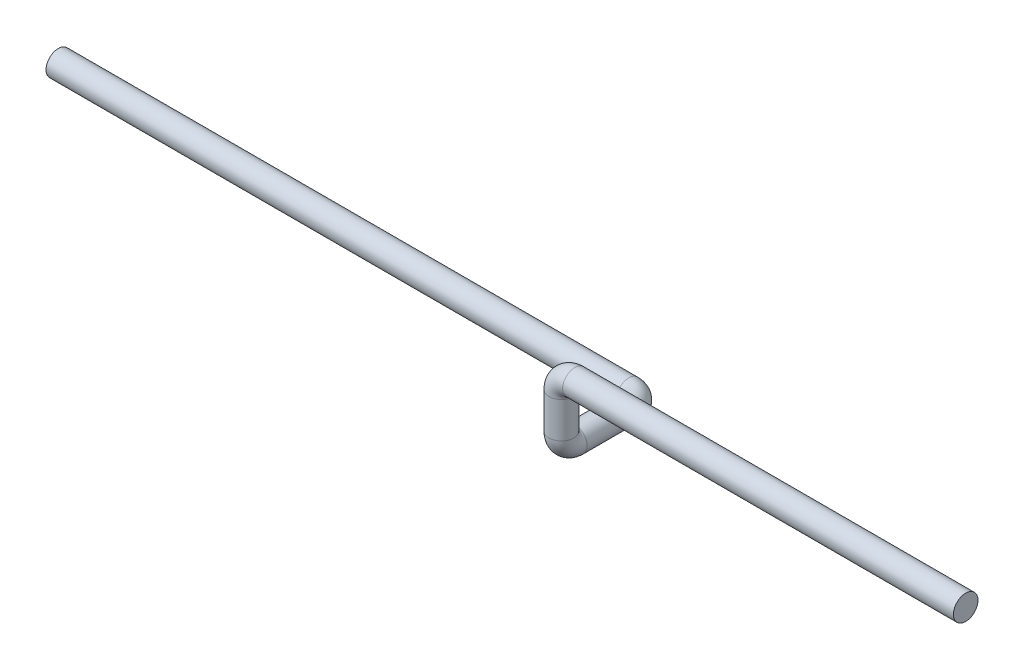
ISO-10303-21;
HEADER;
FILE_DESCRIPTION(('STEP AP214'),'2;1');
FILE_NAME('part.step','',(''),(''),'','','');
FILE_SCHEMA(('AUTOMOTIVE_DESIGN { 1 0 10303 214 1 1 1 1 }'));
ENDSEC;
DATA;
#1=APPLICATION_CONTEXT('core data for automotive mechanical design processes');
#2=APPLICATION_PROTOCOL_DEFINITION('international standard','automotive_design',2000,#1);
#3=PRODUCT_CONTEXT('',#1,'mechanical');
#4=PRODUCT('Part','Part','',(#3));
#5=PRODUCT_RELATED_PRODUCT_CATEGORY('part','',(#4));
#6=PRODUCT_DEFINITION_FORMATION('','',#4);
#7=PRODUCT_DEFINITION_CONTEXT('part definition',#1,'design');
#8=PRODUCT_DEFINITION('design','',#6,#7);
#9=PRODUCT_DEFINITION_SHAPE('','',#8);
#10=(LENGTH_UNIT() NAMED_UNIT(*) SI_UNIT(.MILLI.,.METRE.));
#11=(NAMED_UNIT(*) PLANE_ANGLE_UNIT() SI_UNIT($,.RADIAN.));
#12=(NAMED_UNIT(*) SI_UNIT($,.STERADIAN.) SOLID_ANGLE_UNIT());
#13=UNCERTAINTY_MEASURE_WITH_UNIT(LENGTH_MEASURE(1.E-05),#10,'distance_accuracy_value','');
#14=(GEOMETRIC_REPRESENTATION_CONTEXT(3) GLOBAL_UNCERTAINTY_ASSIGNED_CONTEXT((#13)) GLOBAL_UNIT_ASSIGNED_CONTEXT((#10,
#11,#12)) REPRESENTATION_CONTEXT('',''));
#15=CARTESIAN_POINT('',(0.,0.,0.));
#16=DIRECTION('',(0.,0.,1.));
#17=DIRECTION('',(1.,0.,0.));
#18=AXIS2_PLACEMENT_3D('',#15,#16,#17);
#19=CARTESIAN_POINT('',(0.,0.,0.));
#20=DIRECTION('',(1.,0.,0.));
#21=DIRECTION('',(0.,0.,-1.));
#22=AXIS2_PLACEMENT_3D('',#19,#20,#21);
#23=PLANE('',#22);
#24=CARTESIAN_POINT('',(0.,0.,0.));
#25=DIRECTION('',(1.,0.,0.));
#26=DIRECTION('',(0.,0.,-1.));
#27=AXIS2_PLACEMENT_3D('',#24,#25,#26);
#28=CIRCLE('',#27,13.7);
#29=CARTESIAN_POINT('',(0.,0.,-13.7));
#30=VERTEX_POINT('',#29);
#31=EDGE_CURVE('E47',#30,#30,#28,.T.);
#32=ORIENTED_EDGE('',*,*,#31,.T.);
#33=EDGE_LOOP('',(#32));
#34=FACE_BOUND('',#33,.T.);
#35=ADVANCED_FACE('F35',(#34),#23,.T.);
#36=CARTESIAN_POINT('',(-1100.,-70.,-90.));
#37=DIRECTION('',(1.,0.,0.));
#38=DIRECTION('',(0.,1.,0.));
#39=AXIS2_PLACEMENT_3D('',#36,#37,#38);
#40=PLANE('',#39);
#41=CARTESIAN_POINT('',(-1100.,-70.,-90.));
#42=DIRECTION('',(1.,0.,0.));
#43=DIRECTION('',(0.,1.,0.));
#44=AXIS2_PLACEMENT_3D('',#41,#42,#43);
#45=CIRCLE('',#44,13.7);
#46=CARTESIAN_POINT('',(-1100.,-56.3,-90.));
#47=VERTEX_POINT('',#46);
#48=EDGE_CURVE('E11',#47,#47,#45,.T.);
#49=ORIENTED_EDGE('',*,*,#48,.F.);
#50=EDGE_LOOP('',(#49));
#51=FACE_BOUND('',#50,.T.);
#52=ADVANCED_FACE('F53',(#51),#40,.F.);
#53=CARTESIAN_POINT('',(0.,0.,0.));
#54=DIRECTION('',(-1.,0.,0.));
#55=DIRECTION('',(0.,0.,1.));
#56=AXIS2_PLACEMENT_3D('',#53,#54,#55);
#57=CYLINDRICAL_SURFACE('',#56,13.7);
#58=CARTESIAN_POINT('',(-435.,0.,0.));
#59=DIRECTION('',(1.,0.,0.));
#60=DIRECTION('',(0.,0.,-1.));
#61=AXIS2_PLACEMENT_3D('',#58,#59,#60);
#62=CIRCLE('',#61,13.7);
#63=CARTESIAN_POINT('',(-435.,13.7,0.));
#64=VERTEX_POINT('',#63);
#65=EDGE_CURVE('E95',#64,#64,#62,.T.);
#66=ORIENTED_EDGE('',*,*,#65,.T.);
#67=EDGE_LOOP('',(#66));
#68=FACE_BOUND('',#67,.T.);
#69=ORIENTED_EDGE('',*,*,#31,.F.);
#70=EDGE_LOOP('',(#69));
#71=FACE_BOUND('',#70,.T.);
#72=ADVANCED_FACE('F55',(#68,#71),#57,.T.);
#73=CARTESIAN_POINT('',(-435.,-15.,0.));
#74=DIRECTION('',(0.,0.,1.));
#75=DIRECTION('',(1.,0.,0.));
#76=AXIS2_PLACEMENT_3D('',#73,#74,#75);
#77=TOROIDAL_SURFACE('',#76,15.,13.7);
#78=CARTESIAN_POINT('',(-450.,-15.,0.));
#79=DIRECTION('',(0.,1.,0.));
#80=DIRECTION('',(0.,0.,-1.));
#81=AXIS2_PLACEMENT_3D('',#78,#79,#80);
#82=CIRCLE('',#81,13.7);
#83=CARTESIAN_POINT('',(-463.7,-15.,0.));
#84=VERTEX_POINT('',#83);
#85=EDGE_CURVE('E92',#84,#84,#82,.T.);
#86=CARTESIAN_POINT('',(-435.,-15.,0.));
#87=DIRECTION('',(0.,0.,1.));
#88=DIRECTION('',(1.,0.,0.));
#89=AXIS2_PLACEMENT_3D('',#86,#87,#88);
#90=CIRCLE('',#89,28.7);
#91=EDGE_CURVE('',#64,#84,#90,.T.);
#92=ORIENTED_EDGE('',*,*,#65,.F.);
#93=ORIENTED_EDGE('',*,*,#85,.T.);
#94=ORIENTED_EDGE('',*,*,#91,.T.);
#95=ORIENTED_EDGE('',*,*,#91,.F.);
#96=EDGE_LOOP('',(#92,#94,#93,#95));
#97=FACE_BOUND('',#96,.T.);
#98=ADVANCED_FACE('F60',(#97),#77,.T.);
#99=CARTESIAN_POINT('',(-450.,-15.,0.));
#100=DIRECTION('',(0.,-1.,0.));
#101=DIRECTION('',(0.,0.,-1.));
#102=AXIS2_PLACEMENT_3D('',#99,#100,#101);
#103=CYLINDRICAL_SURFACE('',#102,13.7);
#104=CARTESIAN_POINT('',(-450.,-55.,0.));
#105=DIRECTION('',(0.,1.,0.));
#106=DIRECTION('',(0.,0.,-1.));
#107=AXIS2_PLACEMENT_3D('',#104,#105,#106);
#108=CIRCLE('',#107,13.7);
#109=CARTESIAN_POINT('',(-450.,-55.,13.7));
#110=VERTEX_POINT('',#109);
#111=EDGE_CURVE('E97',#110,#110,#108,.T.);
#112=ORIENTED_EDGE('',*,*,#111,.T.);
#113=EDGE_LOOP('',(#112));
#114=FACE_BOUND('',#113,.T.);
#115=ORIENTED_EDGE('',*,*,#85,.F.);
#116=EDGE_LOOP('',(#115));
#117=FACE_BOUND('',#116,.T.);
#118=ADVANCED_FACE('F80',(#114,#117),#103,.T.);
#119=CARTESIAN_POINT('',(-450.,-55.,-15.));
#120=DIRECTION('',(1.,0.,0.));
#121=DIRECTION('',(0.,0.,-1.));
#122=AXIS2_PLACEMENT_3D('',#119,#120,#121);
#123=TOROIDAL_SURFACE('',#122,15.,13.7);
#124=CARTESIAN_POINT('',(-450.,-70.,-15.));
#125=DIRECTION('',(0.,0.,1.));
#126=DIRECTION('',(0.,1.,0.));
#127=AXIS2_PLACEMENT_3D('',#124,#125,#126);
#128=CIRCLE('',#127,13.7);
#129=CARTESIAN_POINT('',(-450.,-83.7,-15.));
#130=VERTEX_POINT('',#129);
#131=EDGE_CURVE('E103',#130,#130,#128,.T.);
#132=CARTESIAN_POINT('',(-450.,-55.,-15.));
#133=DIRECTION('',(1.,0.,0.));
#134=DIRECTION('',(0.,0.,-1.));
#135=AXIS2_PLACEMENT_3D('',#132,#133,#134);
#136=CIRCLE('',#135,28.7);
#137=EDGE_CURVE('',#110,#130,#136,.T.);
#138=ORIENTED_EDGE('',*,*,#111,.F.);
#139=ORIENTED_EDGE('',*,*,#131,.T.);
#140=ORIENTED_EDGE('',*,*,#137,.T.);
#141=ORIENTED_EDGE('',*,*,#137,.F.);
#142=EDGE_LOOP('',(#138,#140,#139,#141));
#143=FACE_BOUND('',#142,.T.);
#144=ADVANCED_FACE('F76',(#143),#123,.T.);
#145=CARTESIAN_POINT('',(-450.,-70.,-15.));
#146=DIRECTION('',(0.,0.,-1.));
#147=DIRECTION('',(-1.,0.,0.));
#148=AXIS2_PLACEMENT_3D('',#145,#146,#147);
#149=CYLINDRICAL_SURFACE('',#148,13.7);
#150=CARTESIAN_POINT('',(-450.,-70.,-75.));
#151=DIRECTION('',(0.,0.,1.));
#152=DIRECTION('',(0.,1.,0.));
#153=AXIS2_PLACEMENT_3D('',#150,#151,#152);
#154=CIRCLE('',#153,13.7);
#155=CARTESIAN_POINT('',(-436.3,-70.,-75.));
#156=VERTEX_POINT('',#155);
#157=EDGE_CURVE('E106',#156,#156,#154,.T.);
#158=ORIENTED_EDGE('',*,*,#157,.T.);
#159=EDGE_LOOP('',(#158));
#160=FACE_BOUND('',#159,.T.);
#161=ORIENTED_EDGE('',*,*,#131,.F.);
#162=EDGE_LOOP('',(#161));
#163=FACE_BOUND('',#162,.T.);
#164=ADVANCED_FACE('F70',(#160,#163),#149,.T.);
#165=CARTESIAN_POINT('',(-465.,-70.,-75.));
#166=DIRECTION('',(0.,1.,0.));
#167=DIRECTION('',(0.,0.,1.));
#168=AXIS2_PLACEMENT_3D('',#165,#166,#167);
#169=TOROIDAL_SURFACE('',#168,15.,13.7);
#170=CARTESIAN_POINT('',(-465.,-70.,-90.));
#171=DIRECTION('',(1.,0.,0.));
#172=DIRECTION('',(0.,1.,0.));
#173=AXIS2_PLACEMENT_3D('',#170,#171,#172);
#174=CIRCLE('',#173,13.7);
#175=CARTESIAN_POINT('',(-465.,-70.,-103.7));
#176=VERTEX_POINT('',#175);
#177=EDGE_CURVE('E42',#176,#176,#174,.T.);
#178=CARTESIAN_POINT('',(-465.,-70.,-75.));
#179=DIRECTION('',(0.,1.,0.));
#180=DIRECTION('',(0.,0.,1.));
#181=AXIS2_PLACEMENT_3D('',#178,#179,#180);
#182=CIRCLE('',#181,28.7);
#183=EDGE_CURVE('',#156,#176,#182,.T.);
#184=ORIENTED_EDGE('',*,*,#157,.F.);
#185=ORIENTED_EDGE('',*,*,#177,.T.);
#186=ORIENTED_EDGE('',*,*,#183,.T.);
#187=ORIENTED_EDGE('',*,*,#183,.F.);
#188=EDGE_LOOP('',(#184,#186,#185,#187));
#189=FACE_BOUND('',#188,.T.);
#190=ADVANCED_FACE('F66',(#189),#169,.T.);
#191=CARTESIAN_POINT('',(-465.,-70.,-90.));
#192=DIRECTION('',(-1.,0.,0.));
#193=DIRECTION('',(0.,0.,1.));
#194=AXIS2_PLACEMENT_3D('',#191,#192,#193);
#195=CYLINDRICAL_SURFACE('',#194,13.7);
#196=ORIENTED_EDGE('',*,*,#48,.T.);
#197=EDGE_LOOP('',(#196));
#198=FACE_BOUND('',#197,.T.);
#199=ORIENTED_EDGE('',*,*,#177,.F.);
#200=EDGE_LOOP('',(#199));
#201=FACE_BOUND('',#200,.T.);
#202=ADVANCED_FACE('F50',(#198,#201),#195,.T.);
#203=CLOSED_SHELL('',(#35,#52,#72,#98,#118,#144,#164,#190,#202));
#204=MANIFOLD_SOLID_BREP('B2',#203);
#205=ADVANCED_BREP_SHAPE_REPRESENTATION('',(#18,#204),#14);
#206=SHAPE_DEFINITION_REPRESENTATION(#9,#205);
ENDSEC;
END-ISO-10303-21;
